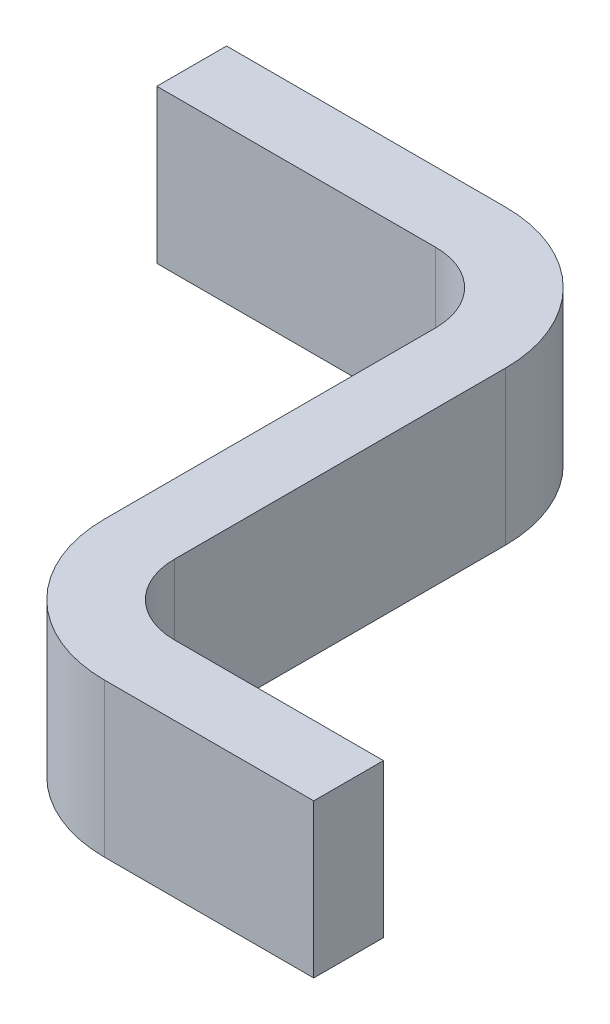
ISO-10303-21;
HEADER;
FILE_DESCRIPTION(('STEP AP214'),'2;1');
FILE_NAME('part.step','',(''),(''),'','','');
FILE_SCHEMA(('AUTOMOTIVE_DESIGN { 1 0 10303 214 1 1 1 1 }'));
ENDSEC;
DATA;
#1=APPLICATION_CONTEXT('core data for automotive mechanical design processes');
#2=APPLICATION_PROTOCOL_DEFINITION('international standard','automotive_design',2000,#1);
#3=PRODUCT_CONTEXT('',#1,'mechanical');
#4=PRODUCT('Part','Part','',(#3));
#5=PRODUCT_RELATED_PRODUCT_CATEGORY('part','',(#4));
#6=PRODUCT_DEFINITION_FORMATION('','',#4);
#7=PRODUCT_DEFINITION_CONTEXT('part definition',#1,'design');
#8=PRODUCT_DEFINITION('design','',#6,#7);
#9=PRODUCT_DEFINITION_SHAPE('','',#8);
#10=(LENGTH_UNIT() NAMED_UNIT(*) SI_UNIT(.MILLI.,.METRE.));
#11=(NAMED_UNIT(*) PLANE_ANGLE_UNIT() SI_UNIT($,.RADIAN.));
#12=(NAMED_UNIT(*) SI_UNIT($,.STERADIAN.) SOLID_ANGLE_UNIT());
#13=UNCERTAINTY_MEASURE_WITH_UNIT(LENGTH_MEASURE(1.E-05),#10,'distance_accuracy_value','');
#14=(GEOMETRIC_REPRESENTATION_CONTEXT(3) GLOBAL_UNCERTAINTY_ASSIGNED_CONTEXT((#13)) GLOBAL_UNIT_ASSIGNED_CONTEXT((#10,
#11,#12)) REPRESENTATION_CONTEXT('',''));
#15=CARTESIAN_POINT('',(0.,0.,0.));
#16=DIRECTION('',(0.,0.,1.));
#17=DIRECTION('',(1.,0.,0.));
#18=AXIS2_PLACEMENT_3D('',#15,#16,#17);
#19=CARTESIAN_POINT('',(-4.,-2.14,0.675));
#20=DIRECTION('',(0.,-1.,0.));
#21=DIRECTION('',(1.,0.,0.));
#22=AXIS2_PLACEMENT_3D('',#19,#20,#21);
#23=PLANE('',#22);
#24=CARTESIAN_POINT('',(-3.8,-2.14,0.675));
#25=DIRECTION('',(0.,1.,0.));
#26=DIRECTION('',(-1.,0.,0.));
#27=AXIS2_PLACEMENT_3D('',#24,#25,#26);
#28=CIRCLE('',#27,0.2);
#29=CARTESIAN_POINT('',(-3.8,-2.14,0.875));
#30=VERTEX_POINT('',#29);
#31=CARTESIAN_POINT('',(-4.,-2.14,0.675));
#32=VERTEX_POINT('',#31);
#33=EDGE_CURVE('E150',#30,#32,#28,.F.);
#34=ORIENTED_EDGE('',*,*,#33,.F.);
#35=DIRECTION('',(-1.,0.,0.));
#36=VECTOR('',#35,1.);
#37=CARTESIAN_POINT('',(-3.5,-2.14,0.875));
#38=LINE('',#37,#36);
#39=CARTESIAN_POINT('',(-3.5,-2.14,0.875));
#40=VERTEX_POINT('',#39);
#41=EDGE_CURVE('E147',#30,#40,#38,.F.);
#42=ORIENTED_EDGE('',*,*,#41,.T.);
#43=DIRECTION('',(0.,0.,1.));
#44=VECTOR('',#43,1.);
#45=CARTESIAN_POINT('',(-3.5,-2.14,0.775));
#46=LINE('',#45,#44);
#47=CARTESIAN_POINT('',(-3.5,-2.14,0.775));
#48=VERTEX_POINT('',#47);
#49=EDGE_CURVE('E141',#48,#40,#46,.T.);
#50=ORIENTED_EDGE('',*,*,#49,.F.);
#51=DIRECTION('',(1.,0.,0.));
#52=VECTOR('',#51,1.);
#53=CARTESIAN_POINT('',(-3.5,-2.14,0.775));
#54=LINE('',#53,#52);
#55=CARTESIAN_POINT('',(-3.8,-2.14,0.775));
#56=VERTEX_POINT('',#55);
#57=EDGE_CURVE('E115',#48,#56,#54,.F.);
#58=ORIENTED_EDGE('',*,*,#57,.T.);
#59=CARTESIAN_POINT('',(-3.8,-2.14,0.675));
#60=DIRECTION('',(0.,1.,0.));
#61=DIRECTION('',(-1.,0.,0.));
#62=AXIS2_PLACEMENT_3D('',#59,#60,#61);
#63=CIRCLE('',#62,0.1);
#64=CARTESIAN_POINT('',(-3.9,-2.14,0.675));
#65=VERTEX_POINT('',#64);
#66=EDGE_CURVE('E215',#56,#65,#63,.F.);
#67=ORIENTED_EDGE('',*,*,#66,.T.);
#68=DIRECTION('',(0.,0.,1.));
#69=VECTOR('',#68,1.);
#70=CARTESIAN_POINT('',(-3.9,-2.14,0.675));
#71=LINE('',#70,#69);
#72=CARTESIAN_POINT('',(-3.9,-2.14,0.2));
#73=VERTEX_POINT('',#72);
#74=EDGE_CURVE('E181',#65,#73,#71,.F.);
#75=ORIENTED_EDGE('',*,*,#74,.T.);
#76=CARTESIAN_POINT('',(-4.1,-2.14,0.2));
#77=DIRECTION('',(0.,-1.,0.));
#78=DIRECTION('',(1.,0.,0.));
#79=AXIS2_PLACEMENT_3D('',#76,#77,#78);
#80=CIRCLE('',#79,0.2);
#81=CARTESIAN_POINT('',(-4.1,-2.14,0.));
#82=VERTEX_POINT('',#81);
#83=EDGE_CURVE('E20',#82,#73,#80,.T.);
#84=ORIENTED_EDGE('',*,*,#83,.F.);
#85=DIRECTION('',(1.,0.,0.));
#86=VECTOR('',#85,1.);
#87=CARTESIAN_POINT('',(-4.1,-2.14,0.));
#88=LINE('',#87,#86);
#89=CARTESIAN_POINT('',(-4.5,-2.14,0.));
#90=VERTEX_POINT('',#89);
#91=EDGE_CURVE('E91',#82,#90,#88,.F.);
#92=ORIENTED_EDGE('',*,*,#91,.T.);
#93=DIRECTION('',(0.,0.,1.));
#94=VECTOR('',#93,1.);
#95=CARTESIAN_POINT('',(-4.5,-2.14,0.));
#96=LINE('',#95,#94);
#97=CARTESIAN_POINT('',(-4.5,-2.14,0.1));
#98=VERTEX_POINT('',#97);
#99=EDGE_CURVE('E163',#90,#98,#96,.T.);
#100=ORIENTED_EDGE('',*,*,#99,.T.);
#101=DIRECTION('',(-1.,0.,0.));
#102=VECTOR('',#101,1.);
#103=CARTESIAN_POINT('',(-4.1,-2.14,0.1));
#104=LINE('',#103,#102);
#105=CARTESIAN_POINT('',(-4.1,-2.14,0.1));
#106=VERTEX_POINT('',#105);
#107=EDGE_CURVE('E159',#98,#106,#104,.F.);
#108=ORIENTED_EDGE('',*,*,#107,.T.);
#109=CARTESIAN_POINT('',(-4.1,-2.14,0.2));
#110=DIRECTION('',(0.,-1.,0.));
#111=DIRECTION('',(1.,0.,0.));
#112=AXIS2_PLACEMENT_3D('',#109,#110,#111);
#113=CIRCLE('',#112,0.1);
#114=CARTESIAN_POINT('',(-4.,-2.14,0.2));
#115=VERTEX_POINT('',#114);
#116=EDGE_CURVE('E155',#106,#115,#113,.T.);
#117=ORIENTED_EDGE('',*,*,#116,.T.);
#118=DIRECTION('',(0.,0.,1.));
#119=VECTOR('',#118,1.);
#120=CARTESIAN_POINT('',(-4.,-2.14,0.675));
#121=LINE('',#120,#119);
#122=EDGE_CURVE('E154',#115,#32,#121,.T.);
#123=ORIENTED_EDGE('',*,*,#122,.T.);
#124=EDGE_LOOP('',(#34,#42,#50,#58,#67,#75,#84,#92,#100,#108,#117,#123));
#125=FACE_BOUND('',#124,.T.);
#126=ADVANCED_FACE('F17',(#125),#23,.F.);
#127=CARTESIAN_POINT('',(-4.1,-2.14,0.2));
#128=DIRECTION('',(0.,-1.,0.));
#129=DIRECTION('',(1.,0.,0.));
#130=AXIS2_PLACEMENT_3D('',#127,#128,#129);
#131=CYLINDRICAL_SURFACE('',#130,0.2);
#132=CARTESIAN_POINT('',(-4.1,-2.36,0.2));
#133=DIRECTION('',(0.,-1.,0.));
#134=DIRECTION('',(1.,0.,0.));
#135=AXIS2_PLACEMENT_3D('',#132,#133,#134);
#136=CIRCLE('',#135,0.2);
#137=CARTESIAN_POINT('',(-3.9,-2.36,0.2));
#138=VERTEX_POINT('',#137);
#139=CARTESIAN_POINT('',(-4.1,-2.36,0.));
#140=VERTEX_POINT('',#139);
#141=EDGE_CURVE('E183',#138,#140,#136,.F.);
#142=ORIENTED_EDGE('',*,*,#141,.T.);
#143=DIRECTION('',(0.,1.,0.));
#144=VECTOR('',#143,1.);
#145=CARTESIAN_POINT('',(-4.1,-2.14,0.));
#146=LINE('',#145,#144);
#147=EDGE_CURVE('E178',#140,#82,#146,.T.);
#148=ORIENTED_EDGE('',*,*,#147,.T.);
#149=ORIENTED_EDGE('',*,*,#83,.T.);
#150=DIRECTION('',(0.,-1.,0.));
#151=VECTOR('',#150,1.);
#152=CARTESIAN_POINT('',(-3.9,-2.14,0.2));
#153=LINE('',#152,#151);
#154=EDGE_CURVE('E217',#73,#138,#153,.T.);
#155=ORIENTED_EDGE('',*,*,#154,.T.);
#156=EDGE_LOOP('',(#142,#148,#149,#155));
#157=FACE_BOUND('',#156,.T.);
#158=ADVANCED_FACE('F254',(#157),#131,.T.);
#159=CARTESIAN_POINT('',(-4.1,-2.14,0.));
#160=DIRECTION('',(0.,0.,1.));
#161=DIRECTION('',(1.,0.,0.));
#162=AXIS2_PLACEMENT_3D('',#159,#160,#161);
#163=PLANE('',#162);
#164=ORIENTED_EDGE('',*,*,#147,.F.);
#165=DIRECTION('',(-1.,0.,0.));
#166=VECTOR('',#165,1.);
#167=CARTESIAN_POINT('',(-3.9,-2.36,0.));
#168=LINE('',#167,#166);
#169=CARTESIAN_POINT('',(-4.5,-2.36,0.));
#170=VERTEX_POINT('',#169);
#171=EDGE_CURVE('E170',#140,#170,#168,.T.);
#172=ORIENTED_EDGE('',*,*,#171,.T.);
#173=DIRECTION('',(0.,1.,0.));
#174=VECTOR('',#173,1.);
#175=CARTESIAN_POINT('',(-4.5,-2.14,0.));
#176=LINE('',#175,#174);
#177=EDGE_CURVE('E173',#170,#90,#176,.T.);
#178=ORIENTED_EDGE('',*,*,#177,.T.);
#179=ORIENTED_EDGE('',*,*,#91,.F.);
#180=EDGE_LOOP('',(#164,#172,#178,#179));
#181=FACE_BOUND('',#180,.T.);
#182=ADVANCED_FACE('F257',(#181),#163,.F.);
#183=CARTESIAN_POINT('',(-4.5,-2.14,0.));
#184=DIRECTION('',(1.,0.,0.));
#185=DIRECTION('',(0.,1.,0.));
#186=AXIS2_PLACEMENT_3D('',#183,#184,#185);
#187=PLANE('',#186);
#188=DIRECTION('',(0.,1.,0.));
#189=VECTOR('',#188,1.);
#190=CARTESIAN_POINT('',(-4.5,-2.36,0.1));
#191=LINE('',#190,#189);
#192=CARTESIAN_POINT('',(-4.5,-2.36,0.1));
#193=VERTEX_POINT('',#192);
#194=EDGE_CURVE('E160',#193,#98,#191,.T.);
#195=ORIENTED_EDGE('',*,*,#194,.T.);
#196=ORIENTED_EDGE('',*,*,#99,.F.);
#197=ORIENTED_EDGE('',*,*,#177,.F.);
#198=DIRECTION('',(0.,0.,1.));
#199=VECTOR('',#198,1.);
#200=CARTESIAN_POINT('',(-4.5,-2.36,0.675));
#201=LINE('',#200,#199);
#202=EDGE_CURVE('E166',#170,#193,#201,.T.);
#203=ORIENTED_EDGE('',*,*,#202,.T.);
#204=EDGE_LOOP('',(#195,#196,#197,#203));
#205=FACE_BOUND('',#204,.T.);
#206=ADVANCED_FACE('F259',(#205),#187,.F.);
#207=CARTESIAN_POINT('',(-4.1,-2.36,0.1));
#208=DIRECTION('',(0.,0.,-1.));
#209=DIRECTION('',(-1.,0.,0.));
#210=AXIS2_PLACEMENT_3D('',#207,#208,#209);
#211=PLANE('',#210);
#212=DIRECTION('',(0.,-1.,0.));
#213=VECTOR('',#212,1.);
#214=CARTESIAN_POINT('',(-4.1,-2.36,0.1));
#215=LINE('',#214,#213);
#216=CARTESIAN_POINT('',(-4.1,-2.36,0.1));
#217=VERTEX_POINT('',#216);
#218=EDGE_CURVE('E156',#217,#106,#215,.F.);
#219=ORIENTED_EDGE('',*,*,#218,.T.);
#220=ORIENTED_EDGE('',*,*,#107,.F.);
#221=ORIENTED_EDGE('',*,*,#194,.F.);
#222=DIRECTION('',(-1.,0.,0.));
#223=VECTOR('',#222,1.);
#224=CARTESIAN_POINT('',(-3.9,-2.36,0.1));
#225=LINE('',#224,#223);
#226=EDGE_CURVE('E169',#193,#217,#225,.F.);
#227=ORIENTED_EDGE('',*,*,#226,.T.);
#228=EDGE_LOOP('',(#219,#220,#221,#227));
#229=FACE_BOUND('',#228,.T.);
#230=ADVANCED_FACE('F234',(#229),#211,.F.);
#231=CARTESIAN_POINT('',(-4.1,-2.36,0.2));
#232=DIRECTION('',(0.,-1.,0.));
#233=DIRECTION('',(1.,0.,0.));
#234=AXIS2_PLACEMENT_3D('',#231,#232,#233);
#235=CYLINDRICAL_SURFACE('',#234,0.1);
#236=DIRECTION('',(0.,1.,0.));
#237=VECTOR('',#236,1.);
#238=CARTESIAN_POINT('',(-4.,-2.36,0.2));
#239=LINE('',#238,#237);
#240=CARTESIAN_POINT('',(-4.,-2.36,0.2));
#241=VERTEX_POINT('',#240);
#242=EDGE_CURVE('E151',#241,#115,#239,.T.);
#243=ORIENTED_EDGE('',*,*,#242,.T.);
#244=ORIENTED_EDGE('',*,*,#116,.F.);
#245=ORIENTED_EDGE('',*,*,#218,.F.);
#246=CARTESIAN_POINT('',(-4.1,-2.36,0.2));
#247=DIRECTION('',(0.,-1.,0.));
#248=DIRECTION('',(1.,0.,0.));
#249=AXIS2_PLACEMENT_3D('',#246,#247,#248);
#250=CIRCLE('',#249,0.1);
#251=EDGE_CURVE('E210',#217,#241,#250,.T.);
#252=ORIENTED_EDGE('',*,*,#251,.T.);
#253=EDGE_LOOP('',(#243,#244,#245,#252));
#254=FACE_BOUND('',#253,.T.);
#255=ADVANCED_FACE('F227',(#254),#235,.F.);
#256=CARTESIAN_POINT('',(-4.,-2.36,0.675));
#257=DIRECTION('',(1.,0.,0.));
#258=DIRECTION('',(0.,1.,0.));
#259=AXIS2_PLACEMENT_3D('',#256,#257,#258);
#260=PLANE('',#259);
#261=DIRECTION('',(0.,1.,0.));
#262=VECTOR('',#261,1.);
#263=CARTESIAN_POINT('',(-4.,-2.36,0.675));
#264=LINE('',#263,#262);
#265=CARTESIAN_POINT('',(-4.,-2.36,0.675));
#266=VERTEX_POINT('',#265);
#267=EDGE_CURVE('E148',#32,#266,#264,.F.);
#268=ORIENTED_EDGE('',*,*,#267,.F.);
#269=ORIENTED_EDGE('',*,*,#122,.F.);
#270=ORIENTED_EDGE('',*,*,#242,.F.);
#271=DIRECTION('',(0.,0.,1.));
#272=VECTOR('',#271,1.);
#273=CARTESIAN_POINT('',(-4.,-2.36,0.675));
#274=LINE('',#273,#272);
#275=EDGE_CURVE('E209',#241,#266,#274,.T.);
#276=ORIENTED_EDGE('',*,*,#275,.T.);
#277=EDGE_LOOP('',(#268,#269,#270,#276));
#278=FACE_BOUND('',#277,.T.);
#279=ADVANCED_FACE('F224',(#278),#260,.F.);
#280=CARTESIAN_POINT('',(-3.8,-2.36,0.675));
#281=DIRECTION('',(0.,1.,0.));
#282=DIRECTION('',(-1.,0.,0.));
#283=AXIS2_PLACEMENT_3D('',#280,#281,#282);
#284=CYLINDRICAL_SURFACE('',#283,0.2);
#285=ORIENTED_EDGE('',*,*,#33,.T.);
#286=ORIENTED_EDGE('',*,*,#267,.T.);
#287=CARTESIAN_POINT('',(-3.8,-2.36,0.675));
#288=DIRECTION('',(0.,1.,0.));
#289=DIRECTION('',(-1.,0.,0.));
#290=AXIS2_PLACEMENT_3D('',#287,#288,#289);
#291=CIRCLE('',#290,0.2);
#292=CARTESIAN_POINT('',(-3.8,-2.36,0.875));
#293=VERTEX_POINT('',#292);
#294=EDGE_CURVE('E133',#266,#293,#291,.T.);
#295=ORIENTED_EDGE('',*,*,#294,.T.);
#296=DIRECTION('',(0.,1.,0.));
#297=VECTOR('',#296,1.);
#298=CARTESIAN_POINT('',(-3.8,-2.36,0.875));
#299=LINE('',#298,#297);
#300=EDGE_CURVE('E144',#293,#30,#299,.T.);
#301=ORIENTED_EDGE('',*,*,#300,.T.);
#302=EDGE_LOOP('',(#285,#286,#295,#301));
#303=FACE_BOUND('',#302,.T.);
#304=ADVANCED_FACE('F285',(#303),#284,.T.);
#305=CARTESIAN_POINT('',(-3.5,-2.36,0.875));
#306=DIRECTION('',(0.,0.,-1.));
#307=DIRECTION('',(-1.,0.,0.));
#308=AXIS2_PLACEMENT_3D('',#305,#306,#307);
#309=PLANE('',#308);
#310=DIRECTION('',(0.,1.,0.));
#311=VECTOR('',#310,1.);
#312=CARTESIAN_POINT('',(-3.5,-2.14,0.875));
#313=LINE('',#312,#311);
#314=CARTESIAN_POINT('',(-3.5,-2.36,0.875));
#315=VERTEX_POINT('',#314);
#316=EDGE_CURVE('E118',#40,#315,#313,.F.);
#317=ORIENTED_EDGE('',*,*,#316,.F.);
#318=ORIENTED_EDGE('',*,*,#41,.F.);
#319=ORIENTED_EDGE('',*,*,#300,.F.);
#320=DIRECTION('',(-1.,0.,0.));
#321=VECTOR('',#320,1.);
#322=CARTESIAN_POINT('',(-3.9,-2.36,0.875));
#323=LINE('',#322,#321);
#324=EDGE_CURVE('E131',#293,#315,#323,.F.);
#325=ORIENTED_EDGE('',*,*,#324,.T.);
#326=EDGE_LOOP('',(#317,#318,#319,#325));
#327=FACE_BOUND('',#326,.T.);
#328=ADVANCED_FACE('F282',(#327),#309,.F.);
#329=CARTESIAN_POINT('',(-3.5,-2.14,0.775));
#330=DIRECTION('',(1.,0.,0.));
#331=DIRECTION('',(0.,1.,0.));
#332=AXIS2_PLACEMENT_3D('',#329,#330,#331);
#333=PLANE('',#332);
#334=ORIENTED_EDGE('',*,*,#49,.T.);
#335=ORIENTED_EDGE('',*,*,#316,.T.);
#336=DIRECTION('',(0.,0.,1.));
#337=VECTOR('',#336,1.);
#338=CARTESIAN_POINT('',(-3.5,-2.36,0.675));
#339=LINE('',#338,#337);
#340=CARTESIAN_POINT('',(-3.5,-2.36,0.775));
#341=VERTEX_POINT('',#340);
#342=EDGE_CURVE('E125',#315,#341,#339,.F.);
#343=ORIENTED_EDGE('',*,*,#342,.T.);
#344=DIRECTION('',(0.,1.,0.));
#345=VECTOR('',#344,1.);
#346=CARTESIAN_POINT('',(-3.5,-2.14,0.775));
#347=LINE('',#346,#345);
#348=EDGE_CURVE('E110',#341,#48,#347,.T.);
#349=ORIENTED_EDGE('',*,*,#348,.T.);
#350=EDGE_LOOP('',(#334,#335,#343,#349));
#351=FACE_BOUND('',#350,.T.);
#352=ADVANCED_FACE('F129',(#351),#333,.T.);
#353=CARTESIAN_POINT('',(-3.5,-2.14,0.775));
#354=DIRECTION('',(0.,0.,1.));
#355=DIRECTION('',(1.,0.,0.));
#356=AXIS2_PLACEMENT_3D('',#353,#354,#355);
#357=PLANE('',#356);
#358=ORIENTED_EDGE('',*,*,#348,.F.);
#359=DIRECTION('',(-1.,0.,0.));
#360=VECTOR('',#359,1.);
#361=CARTESIAN_POINT('',(-3.9,-2.36,0.775));
#362=LINE('',#361,#360);
#363=CARTESIAN_POINT('',(-3.8,-2.36,0.775));
#364=VERTEX_POINT('',#363);
#365=EDGE_CURVE('E114',#341,#364,#362,.T.);
#366=ORIENTED_EDGE('',*,*,#365,.T.);
#367=DIRECTION('',(0.,1.,0.));
#368=VECTOR('',#367,1.);
#369=CARTESIAN_POINT('',(-3.8,-2.14,0.775));
#370=LINE('',#369,#368);
#371=EDGE_CURVE('E185',#364,#56,#370,.T.);
#372=ORIENTED_EDGE('',*,*,#371,.T.);
#373=ORIENTED_EDGE('',*,*,#57,.F.);
#374=EDGE_LOOP('',(#358,#366,#372,#373));
#375=FACE_BOUND('',#374,.T.);
#376=ADVANCED_FACE('F112',(#375),#357,.F.);
#377=CARTESIAN_POINT('',(-3.8,-2.14,0.675));
#378=DIRECTION('',(0.,1.,0.));
#379=DIRECTION('',(-1.,0.,0.));
#380=AXIS2_PLACEMENT_3D('',#377,#378,#379);
#381=CYLINDRICAL_SURFACE('',#380,0.1);
#382=ORIENTED_EDGE('',*,*,#371,.F.);
#383=CARTESIAN_POINT('',(-3.8,-2.36,0.675));
#384=DIRECTION('',(0.,1.,0.));
#385=DIRECTION('',(-1.,0.,0.));
#386=AXIS2_PLACEMENT_3D('',#383,#384,#385);
#387=CIRCLE('',#386,0.1);
#388=CARTESIAN_POINT('',(-3.9,-2.36,0.675));
#389=VERTEX_POINT('',#388);
#390=EDGE_CURVE('E26',#364,#389,#387,.F.);
#391=ORIENTED_EDGE('',*,*,#390,.T.);
#392=DIRECTION('',(0.,-1.,0.));
#393=VECTOR('',#392,1.);
#394=CARTESIAN_POINT('',(-3.9,-2.14,0.675));
#395=LINE('',#394,#393);
#396=EDGE_CURVE('E34',#389,#65,#395,.F.);
#397=ORIENTED_EDGE('',*,*,#396,.T.);
#398=ORIENTED_EDGE('',*,*,#66,.F.);
#399=EDGE_LOOP('',(#382,#391,#397,#398));
#400=FACE_BOUND('',#399,.T.);
#401=ADVANCED_FACE('F250',(#400),#381,.F.);
#402=CARTESIAN_POINT('',(-3.9,-2.14,0.675));
#403=DIRECTION('',(-1.,0.,0.));
#404=DIRECTION('',(0.,-1.,0.));
#405=AXIS2_PLACEMENT_3D('',#402,#403,#404);
#406=PLANE('',#405);
#407=ORIENTED_EDGE('',*,*,#396,.F.);
#408=DIRECTION('',(0.,0.,1.));
#409=VECTOR('',#408,1.);
#410=CARTESIAN_POINT('',(-3.9,-2.36,0.675));
#411=LINE('',#410,#409);
#412=EDGE_CURVE('E11',#389,#138,#411,.F.);
#413=ORIENTED_EDGE('',*,*,#412,.T.);
#414=ORIENTED_EDGE('',*,*,#154,.F.);
#415=ORIENTED_EDGE('',*,*,#74,.F.);
#416=EDGE_LOOP('',(#407,#413,#414,#415));
#417=FACE_BOUND('',#416,.T.);
#418=ADVANCED_FACE('F252',(#417),#406,.F.);
#419=CARTESIAN_POINT('',(-3.9,-2.36,0.675));
#420=DIRECTION('',(0.,1.,0.));
#421=DIRECTION('',(-1.,0.,0.));
#422=AXIS2_PLACEMENT_3D('',#419,#420,#421);
#423=PLANE('',#422);
#424=ORIENTED_EDGE('',*,*,#390,.F.);
#425=ORIENTED_EDGE('',*,*,#365,.F.);
#426=ORIENTED_EDGE('',*,*,#342,.F.);
#427=ORIENTED_EDGE('',*,*,#324,.F.);
#428=ORIENTED_EDGE('',*,*,#294,.F.);
#429=ORIENTED_EDGE('',*,*,#275,.F.);
#430=ORIENTED_EDGE('',*,*,#251,.F.);
#431=ORIENTED_EDGE('',*,*,#226,.F.);
#432=ORIENTED_EDGE('',*,*,#202,.F.);
#433=ORIENTED_EDGE('',*,*,#171,.F.);
#434=ORIENTED_EDGE('',*,*,#141,.F.);
#435=ORIENTED_EDGE('',*,*,#412,.F.);
#436=EDGE_LOOP('',(#424,#425,#426,#427,#428,#429,#430,#431,#432,#433,#434,#435));
#437=FACE_BOUND('',#436,.T.);
#438=ADVANCED_FACE('F123',(#437),#423,.F.);
#439=CLOSED_SHELL('',(#126,#158,#182,#206,#230,#255,#279,#304,#328,#352,#376,#401,#418,#438));
#440=MANIFOLD_SOLID_BREP('B1',#439);
#441=ADVANCED_BREP_SHAPE_REPRESENTATION('',(#18,#440),#14);
#442=SHAPE_DEFINITION_REPRESENTATION(#9,#441);
ENDSEC;
END-ISO-10303-21;
